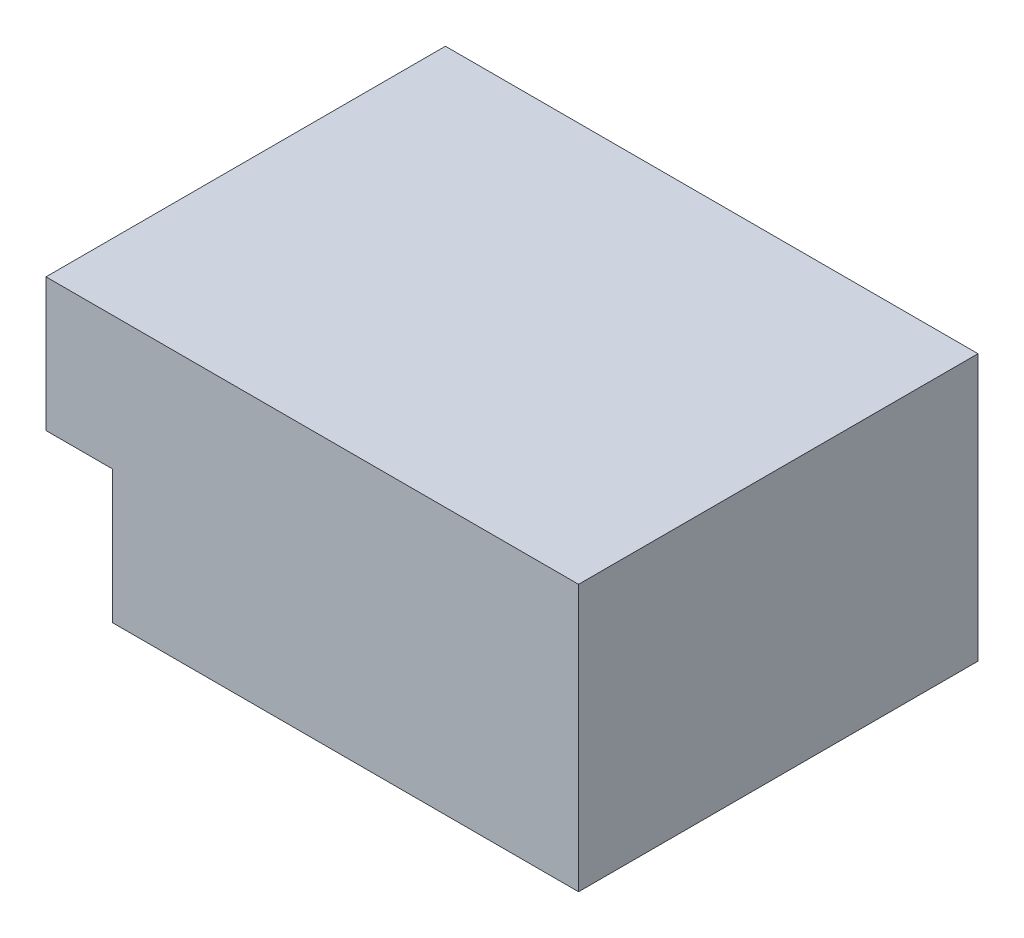
ISO-10303-21;
HEADER;
FILE_DESCRIPTION(('STEP AP214'),'2;1');
FILE_NAME('part.step','',(''),(''),'','','');
FILE_SCHEMA(('AUTOMOTIVE_DESIGN { 1 0 10303 214 1 1 1 1 }'));
ENDSEC;
DATA;
#1=APPLICATION_CONTEXT('core data for automotive mechanical design processes');
#2=APPLICATION_PROTOCOL_DEFINITION('international standard','automotive_design',2000,#1);
#3=PRODUCT_CONTEXT('',#1,'mechanical');
#4=PRODUCT('Part','Part','',(#3));
#5=PRODUCT_RELATED_PRODUCT_CATEGORY('part','',(#4));
#6=PRODUCT_DEFINITION_FORMATION('','',#4);
#7=PRODUCT_DEFINITION_CONTEXT('part definition',#1,'design');
#8=PRODUCT_DEFINITION('design','',#6,#7);
#9=PRODUCT_DEFINITION_SHAPE('','',#8);
#10=(LENGTH_UNIT() NAMED_UNIT(*) SI_UNIT(.MILLI.,.METRE.));
#11=(NAMED_UNIT(*) PLANE_ANGLE_UNIT() SI_UNIT($,.RADIAN.));
#12=(NAMED_UNIT(*) SI_UNIT($,.STERADIAN.) SOLID_ANGLE_UNIT());
#13=UNCERTAINTY_MEASURE_WITH_UNIT(LENGTH_MEASURE(1.E-05),#10,'distance_accuracy_value','');
#14=(GEOMETRIC_REPRESENTATION_CONTEXT(3) GLOBAL_UNCERTAINTY_ASSIGNED_CONTEXT((#13)) GLOBAL_UNIT_ASSIGNED_CONTEXT((#10,
#11,#12)) REPRESENTATION_CONTEXT('',''));
#15=CARTESIAN_POINT('',(0.,0.,0.));
#16=DIRECTION('',(0.,0.,1.));
#17=DIRECTION('',(1.,0.,0.));
#18=AXIS2_PLACEMENT_3D('',#15,#16,#17);
#19=CARTESIAN_POINT('',(0.,0.,0.));
#20=DIRECTION('',(0.,-1.,0.));
#21=DIRECTION('',(-1.,0.,0.));
#22=AXIS2_PLACEMENT_3D('',#19,#20,#21);
#23=PLANE('',#22);
#24=DIRECTION('',(0.,0.,-1.));
#25=VECTOR('',#24,1.);
#26=CARTESIAN_POINT('',(-1.95,0.,0.55));
#27=LINE('',#26,#25);
#28=CARTESIAN_POINT('',(-1.95,0.,0.55));
#29=VERTEX_POINT('',#28);
#30=CARTESIAN_POINT('',(-1.95,0.,0.25));
#31=VERTEX_POINT('',#30);
#32=EDGE_CURVE('E11',#29,#31,#27,.T.);
#33=ORIENTED_EDGE('',*,*,#32,.T.);
#34=DIRECTION('',(1.,0.,0.));
#35=VECTOR('',#34,1.);
#36=CARTESIAN_POINT('',(-1.95,0.,0.25));
#37=LINE('',#36,#35);
#38=CARTESIAN_POINT('',(-1.6,0.,0.25));
#39=VERTEX_POINT('',#38);
#40=EDGE_CURVE('E115',#31,#39,#37,.T.);
#41=ORIENTED_EDGE('',*,*,#40,.T.);
#42=DIRECTION('',(0.,0.,-1.));
#43=VECTOR('',#42,1.);
#44=CARTESIAN_POINT('',(-1.6,0.,0.55));
#45=LINE('',#44,#43);
#46=CARTESIAN_POINT('',(-1.6,0.,0.55));
#47=VERTEX_POINT('',#46);
#48=EDGE_CURVE('E109',#47,#39,#45,.T.);
#49=ORIENTED_EDGE('',*,*,#48,.F.);
#50=DIRECTION('',(-1.,0.,0.));
#51=VECTOR('',#50,1.);
#52=CARTESIAN_POINT('',(-1.6,0.,0.55));
#53=LINE('',#52,#51);
#54=EDGE_CURVE('E101',#47,#29,#53,.T.);
#55=ORIENTED_EDGE('',*,*,#54,.T.);
#56=EDGE_LOOP('',(#33,#41,#49,#55));
#57=FACE_BOUND('',#56,.T.);
#58=ADVANCED_FACE('F17',(#57),#23,.T.);
#59=CARTESIAN_POINT('',(-1.75,0.,0.55));
#60=DIRECTION('',(0.,0.,-1.));
#61=DIRECTION('',(-1.,0.,0.));
#62=AXIS2_PLACEMENT_3D('',#59,#60,#61);
#63=PLANE('',#62);
#64=DIRECTION('',(0.,1.,0.));
#65=VECTOR('',#64,1.);
#66=CARTESIAN_POINT('',(-2.,0.1,0.55));
#67=LINE('',#66,#65);
#68=CARTESIAN_POINT('',(-2.,0.1,0.55));
#69=VERTEX_POINT('',#68);
#70=CARTESIAN_POINT('',(-2.,0.2,0.55));
#71=VERTEX_POINT('',#70);
#72=EDGE_CURVE('E24',#69,#71,#67,.T.);
#73=ORIENTED_EDGE('',*,*,#72,.F.);
#74=DIRECTION('',(1.,0.,0.));
#75=VECTOR('',#74,1.);
#76=CARTESIAN_POINT('',(-2.,0.1,0.55));
#77=LINE('',#76,#75);
#78=CARTESIAN_POINT('',(-1.95,0.1,0.55));
#79=VERTEX_POINT('',#78);
#80=EDGE_CURVE('E85',#69,#79,#77,.T.);
#81=ORIENTED_EDGE('',*,*,#80,.T.);
#82=DIRECTION('',(0.,1.,0.));
#83=VECTOR('',#82,1.);
#84=CARTESIAN_POINT('',(-1.95,0.,0.55));
#85=LINE('',#84,#83);
#86=EDGE_CURVE('E103',#29,#79,#85,.T.);
#87=ORIENTED_EDGE('',*,*,#86,.F.);
#88=ORIENTED_EDGE('',*,*,#54,.F.);
#89=DIRECTION('',(0.,1.,0.));
#90=VECTOR('',#89,1.);
#91=CARTESIAN_POINT('',(-1.6,0.,0.55));
#92=LINE('',#91,#90);
#93=CARTESIAN_POINT('',(-1.6,0.2,0.55));
#94=VERTEX_POINT('',#93);
#95=EDGE_CURVE('E80',#47,#94,#92,.T.);
#96=ORIENTED_EDGE('',*,*,#95,.T.);
#97=DIRECTION('',(-1.,0.,0.));
#98=VECTOR('',#97,1.);
#99=CARTESIAN_POINT('',(-1.6,0.2,0.55));
#100=LINE('',#99,#98);
#101=EDGE_CURVE('E79',#94,#71,#100,.T.);
#102=ORIENTED_EDGE('',*,*,#101,.T.);
#103=EDGE_LOOP('',(#73,#81,#87,#88,#96,#102));
#104=FACE_BOUND('',#103,.T.);
#105=ADVANCED_FACE('F117',(#104),#63,.F.);
#106=CARTESIAN_POINT('',(0.,0.2,0.));
#107=DIRECTION('',(0.,-1.,0.));
#108=DIRECTION('',(-1.,0.,0.));
#109=AXIS2_PLACEMENT_3D('',#106,#107,#108);
#110=PLANE('',#109);
#111=DIRECTION('',(1.,0.,0.));
#112=VECTOR('',#111,1.);
#113=CARTESIAN_POINT('',(-2.,0.2,0.25));
#114=LINE('',#113,#112);
#115=CARTESIAN_POINT('',(-2.,0.2,0.25));
#116=VERTEX_POINT('',#115);
#117=CARTESIAN_POINT('',(-1.6,0.2,0.25));
#118=VERTEX_POINT('',#117);
#119=EDGE_CURVE('E113',#116,#118,#114,.T.);
#120=ORIENTED_EDGE('',*,*,#119,.F.);
#121=DIRECTION('',(0.,0.,-1.));
#122=VECTOR('',#121,1.);
#123=CARTESIAN_POINT('',(-2.,0.2,0.55));
#124=LINE('',#123,#122);
#125=EDGE_CURVE('E91',#71,#116,#124,.T.);
#126=ORIENTED_EDGE('',*,*,#125,.F.);
#127=ORIENTED_EDGE('',*,*,#101,.F.);
#128=DIRECTION('',(0.,0.,1.));
#129=VECTOR('',#128,1.);
#130=CARTESIAN_POINT('',(-1.6,0.2,0.25));
#131=LINE('',#130,#129);
#132=EDGE_CURVE('E98',#118,#94,#131,.T.);
#133=ORIENTED_EDGE('',*,*,#132,.F.);
#134=EDGE_LOOP('',(#120,#126,#127,#133));
#135=FACE_BOUND('',#134,.T.);
#136=ADVANCED_FACE('F122',(#135),#110,.F.);
#137=CARTESIAN_POINT('',(-1.6,0.,0.55));
#138=DIRECTION('',(1.,0.,0.));
#139=DIRECTION('',(0.,0.,-1.));
#140=AXIS2_PLACEMENT_3D('',#137,#138,#139);
#141=PLANE('',#140);
#142=DIRECTION('',(0.,1.,0.));
#143=VECTOR('',#142,1.);
#144=CARTESIAN_POINT('',(-1.6,0.,0.25));
#145=LINE('',#144,#143);
#146=EDGE_CURVE('E107',#39,#118,#145,.T.);
#147=ORIENTED_EDGE('',*,*,#146,.T.);
#148=ORIENTED_EDGE('',*,*,#132,.T.);
#149=ORIENTED_EDGE('',*,*,#95,.F.);
#150=ORIENTED_EDGE('',*,*,#48,.T.);
#151=EDGE_LOOP('',(#147,#148,#149,#150));
#152=FACE_BOUND('',#151,.T.);
#153=ADVANCED_FACE('F125',(#152),#141,.T.);
#154=CARTESIAN_POINT('',(-2.,0.,0.25));
#155=DIRECTION('',(0.,0.,1.));
#156=DIRECTION('',(1.,0.,0.));
#157=AXIS2_PLACEMENT_3D('',#154,#155,#156);
#158=PLANE('',#157);
#159=DIRECTION('',(0.,1.,0.));
#160=VECTOR('',#159,1.);
#161=CARTESIAN_POINT('',(-1.95,0.,0.25));
#162=LINE('',#161,#160);
#163=CARTESIAN_POINT('',(-1.95,0.1,0.25));
#164=VERTEX_POINT('',#163);
#165=EDGE_CURVE('E75',#31,#164,#162,.T.);
#166=ORIENTED_EDGE('',*,*,#165,.T.);
#167=DIRECTION('',(1.,0.,0.));
#168=VECTOR('',#167,1.);
#169=CARTESIAN_POINT('',(-2.,0.1,0.25));
#170=LINE('',#169,#168);
#171=CARTESIAN_POINT('',(-2.,0.1,0.25));
#172=VERTEX_POINT('',#171);
#173=EDGE_CURVE('E68',#172,#164,#170,.T.);
#174=ORIENTED_EDGE('',*,*,#173,.F.);
#175=DIRECTION('',(0.,1.,0.));
#176=VECTOR('',#175,1.);
#177=CARTESIAN_POINT('',(-2.,0.1,0.25));
#178=LINE('',#177,#176);
#179=EDGE_CURVE('E73',#172,#116,#178,.T.);
#180=ORIENTED_EDGE('',*,*,#179,.T.);
#181=ORIENTED_EDGE('',*,*,#119,.T.);
#182=ORIENTED_EDGE('',*,*,#146,.F.);
#183=ORIENTED_EDGE('',*,*,#40,.F.);
#184=EDGE_LOOP('',(#166,#174,#180,#181,#182,#183));
#185=FACE_BOUND('',#184,.T.);
#186=ADVANCED_FACE('F70',(#185),#158,.F.);
#187=CARTESIAN_POINT('',(-2.,0.,0.55));
#188=DIRECTION('',(1.,0.,0.));
#189=DIRECTION('',(0.,0.,-1.));
#190=AXIS2_PLACEMENT_3D('',#187,#188,#189);
#191=PLANE('',#190);
#192=ORIENTED_EDGE('',*,*,#72,.T.);
#193=ORIENTED_EDGE('',*,*,#125,.T.);
#194=ORIENTED_EDGE('',*,*,#179,.F.);
#195=DIRECTION('',(0.,0.,-1.));
#196=VECTOR('',#195,1.);
#197=CARTESIAN_POINT('',(-2.,0.1,0.55));
#198=LINE('',#197,#196);
#199=EDGE_CURVE('E83',#69,#172,#198,.T.);
#200=ORIENTED_EDGE('',*,*,#199,.F.);
#201=EDGE_LOOP('',(#192,#193,#194,#200));
#202=FACE_BOUND('',#201,.T.);
#203=ADVANCED_FACE('F90',(#202),#191,.F.);
#204=CARTESIAN_POINT('',(-2.,0.1,-1.92));
#205=DIRECTION('',(0.,-1.,0.));
#206=DIRECTION('',(1.,0.,0.));
#207=AXIS2_PLACEMENT_3D('',#204,#205,#206);
#208=PLANE('',#207);
#209=ORIENTED_EDGE('',*,*,#80,.F.);
#210=ORIENTED_EDGE('',*,*,#199,.T.);
#211=ORIENTED_EDGE('',*,*,#173,.T.);
#212=DIRECTION('',(0.,0.,1.));
#213=VECTOR('',#212,1.);
#214=CARTESIAN_POINT('',(-1.95,0.1,0.25));
#215=LINE('',#214,#213);
#216=EDGE_CURVE('E87',#164,#79,#215,.T.);
#217=ORIENTED_EDGE('',*,*,#216,.T.);
#218=EDGE_LOOP('',(#209,#210,#211,#217));
#219=FACE_BOUND('',#218,.T.);
#220=ADVANCED_FACE('F84',(#219),#208,.T.);
#221=CARTESIAN_POINT('',(-1.95,0.1,-1.92));
#222=DIRECTION('',(-1.,0.,0.));
#223=DIRECTION('',(0.,-1.,0.));
#224=AXIS2_PLACEMENT_3D('',#221,#222,#223);
#225=PLANE('',#224);
#226=ORIENTED_EDGE('',*,*,#165,.F.);
#227=ORIENTED_EDGE('',*,*,#32,.F.);
#228=ORIENTED_EDGE('',*,*,#86,.T.);
#229=ORIENTED_EDGE('',*,*,#216,.F.);
#230=EDGE_LOOP('',(#226,#227,#228,#229));
#231=FACE_BOUND('',#230,.T.);
#232=ADVANCED_FACE('F127',(#231),#225,.T.);
#233=CLOSED_SHELL('',(#58,#105,#136,#153,#186,#203,#220,#232));
#234=MANIFOLD_SOLID_BREP('B1',#233);
#235=ADVANCED_BREP_SHAPE_REPRESENTATION('',(#18,#234),#14);
#236=SHAPE_DEFINITION_REPRESENTATION(#9,#235);
ENDSEC;
END-ISO-10303-21;
